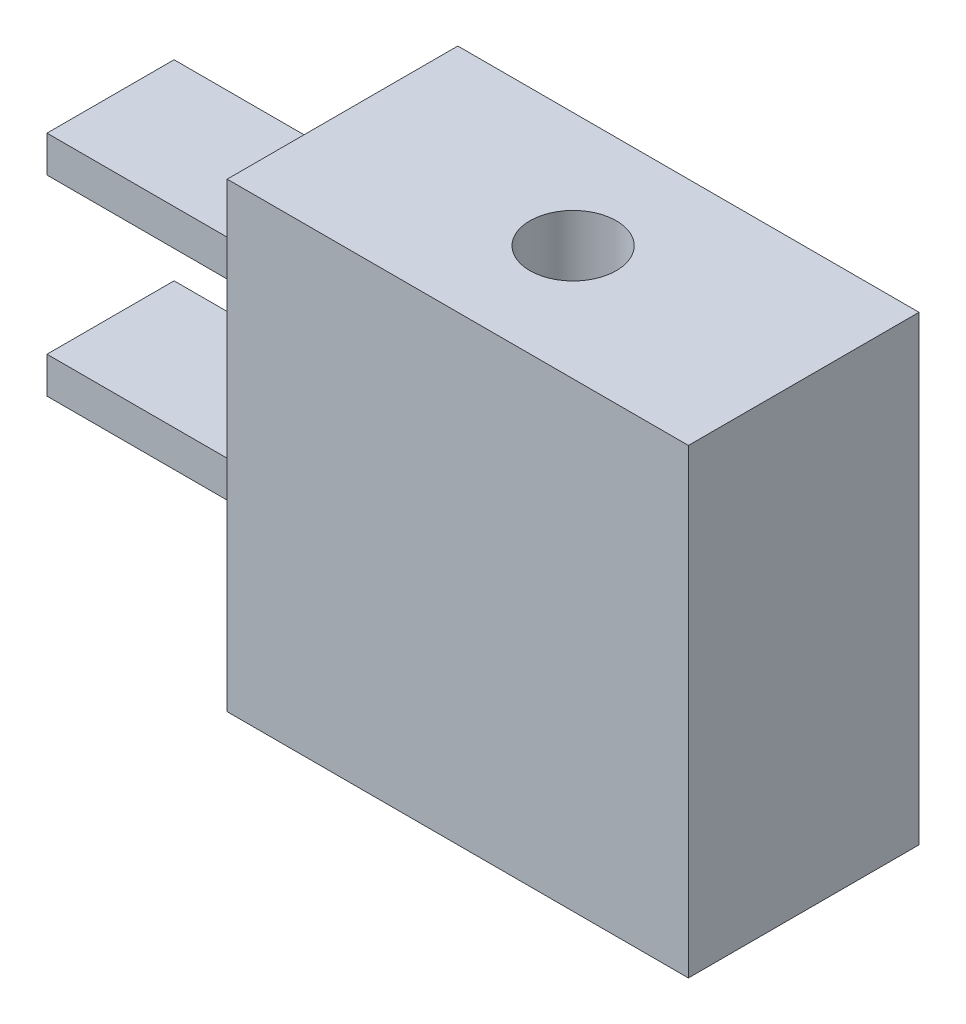
ISO-10303-21;
HEADER;
FILE_DESCRIPTION(('STEP AP214'),'2;1');
FILE_NAME('part.step','',(''),(''),'','','');
FILE_SCHEMA(('AUTOMOTIVE_DESIGN { 1 0 10303 214 1 1 1 1 }'));
ENDSEC;
DATA;
#1=APPLICATION_CONTEXT('core data for automotive mechanical design processes');
#2=APPLICATION_PROTOCOL_DEFINITION('international standard','automotive_design',2000,#1);
#3=PRODUCT_CONTEXT('',#1,'mechanical');
#4=PRODUCT('Part','Part','',(#3));
#5=PRODUCT_RELATED_PRODUCT_CATEGORY('part','',(#4));
#6=PRODUCT_DEFINITION_FORMATION('','',#4);
#7=PRODUCT_DEFINITION_CONTEXT('part definition',#1,'design');
#8=PRODUCT_DEFINITION('design','',#6,#7);
#9=PRODUCT_DEFINITION_SHAPE('','',#8);
#10=(LENGTH_UNIT() NAMED_UNIT(*) SI_UNIT(.MILLI.,.METRE.));
#11=(NAMED_UNIT(*) PLANE_ANGLE_UNIT() SI_UNIT($,.RADIAN.));
#12=(NAMED_UNIT(*) SI_UNIT($,.STERADIAN.) SOLID_ANGLE_UNIT());
#13=UNCERTAINTY_MEASURE_WITH_UNIT(LENGTH_MEASURE(1.E-05),#10,'distance_accuracy_value','');
#14=(GEOMETRIC_REPRESENTATION_CONTEXT(3) GLOBAL_UNCERTAINTY_ASSIGNED_CONTEXT((#13)) GLOBAL_UNIT_ASSIGNED_CONTEXT((#10,
#11,#12)) REPRESENTATION_CONTEXT('',''));
#15=CARTESIAN_POINT('',(0.,0.,0.));
#16=DIRECTION('',(0.,0.,1.));
#17=DIRECTION('',(1.,0.,0.));
#18=AXIS2_PLACEMENT_3D('',#15,#16,#17);
#19=CARTESIAN_POINT('',(-6.35,12.7,3.175));
#20=DIRECTION('',(1.,0.,0.));
#21=DIRECTION('',(0.,0.,-1.));
#22=AXIS2_PLACEMENT_3D('',#19,#20,#21);
#23=PLANE('',#22);
#24=DIRECTION('',(0.,1.,0.));
#25=VECTOR('',#24,1.);
#26=CARTESIAN_POINT('',(-6.35,3.65650049828048,1.78745804836316));
#27=LINE('',#26,#25);
#28=CARTESIAN_POINT('',(-6.35,3.65650049828048,1.78745804836316));
#29=VERTEX_POINT('',#28);
#30=CARTESIAN_POINT('',(-6.35,4.65650049828048,1.78745804836316));
#31=VERTEX_POINT('',#30);
#32=EDGE_CURVE('E147',#29,#31,#27,.T.);
#33=ORIENTED_EDGE('',*,*,#32,.F.);
#34=DIRECTION('',(0.,0.,1.));
#35=VECTOR('',#34,1.);
#36=CARTESIAN_POINT('',(-6.35,3.65650049828048,-1.71254195163684));
#37=LINE('',#36,#35);
#38=CARTESIAN_POINT('',(-6.35,3.65650049828048,-1.71254195163684));
#39=VERTEX_POINT('',#38);
#40=EDGE_CURVE('E160',#39,#29,#37,.T.);
#41=ORIENTED_EDGE('',*,*,#40,.F.);
#42=DIRECTION('',(0.,-1.,0.));
#43=VECTOR('',#42,1.);
#44=CARTESIAN_POINT('',(-6.35,3.65650049828048,-1.71254195163684));
#45=LINE('',#44,#43);
#46=CARTESIAN_POINT('',(-6.35,4.65650049828048,-1.71254195163684));
#47=VERTEX_POINT('',#46);
#48=EDGE_CURVE('E169',#47,#39,#45,.T.);
#49=ORIENTED_EDGE('',*,*,#48,.F.);
#50=DIRECTION('',(0.,0.,-1.));
#51=VECTOR('',#50,1.);
#52=CARTESIAN_POINT('',(-6.35,4.65650049828048,-1.71254195163684));
#53=LINE('',#52,#51);
#54=EDGE_CURVE('E150',#31,#47,#53,.T.);
#55=ORIENTED_EDGE('',*,*,#54,.F.);
#56=EDGE_LOOP('',(#33,#41,#49,#55));
#57=FACE_BOUND('',#56,.T.);
#58=DIRECTION('',(0.,0.,1.));
#59=VECTOR('',#58,1.);
#60=CARTESIAN_POINT('',(-6.35,0.,3.175));
#61=LINE('',#60,#59);
#62=CARTESIAN_POINT('',(-6.35,0.,-3.175));
#63=VERTEX_POINT('',#62);
#64=CARTESIAN_POINT('',(-6.35,0.,3.175));
#65=VERTEX_POINT('',#64);
#66=EDGE_CURVE('E207',#63,#65,#61,.T.);
#67=ORIENTED_EDGE('',*,*,#66,.T.);
#68=DIRECTION('',(0.,-1.,0.));
#69=VECTOR('',#68,1.);
#70=CARTESIAN_POINT('',(-6.35,12.7,3.175));
#71=LINE('',#70,#69);
#72=CARTESIAN_POINT('',(-6.35,12.7,3.175));
#73=VERTEX_POINT('',#72);
#74=EDGE_CURVE('E212',#73,#65,#71,.T.);
#75=ORIENTED_EDGE('',*,*,#74,.F.);
#76=DIRECTION('',(0.,0.,1.));
#77=VECTOR('',#76,1.);
#78=CARTESIAN_POINT('',(-6.35,12.7,3.175));
#79=LINE('',#78,#77);
#80=CARTESIAN_POINT('',(-6.35,12.7,-3.175));
#81=VERTEX_POINT('',#80);
#82=EDGE_CURVE('E198',#81,#73,#79,.T.);
#83=ORIENTED_EDGE('',*,*,#82,.F.);
#84=DIRECTION('',(0.,-1.,0.));
#85=VECTOR('',#84,1.);
#86=CARTESIAN_POINT('',(-6.35,12.7,-3.175));
#87=LINE('',#86,#85);
#88=EDGE_CURVE('E45',#81,#63,#87,.T.);
#89=ORIENTED_EDGE('',*,*,#88,.T.);
#90=EDGE_LOOP('',(#67,#75,#83,#89));
#91=FACE_BOUND('',#90,.T.);
#92=DIRECTION('',(0.,1.,0.));
#93=VECTOR('',#92,1.);
#94=CARTESIAN_POINT('',(-6.35,8.92854928618669,1.78745804836316));
#95=LINE('',#94,#93);
#96=CARTESIAN_POINT('',(-6.35,8.92854928618669,1.78745804836316));
#97=VERTEX_POINT('',#96);
#98=CARTESIAN_POINT('',(-6.35,9.92854928618669,1.78745804836316));
#99=VERTEX_POINT('',#98);
#100=EDGE_CURVE('E146',#97,#99,#95,.T.);
#101=ORIENTED_EDGE('',*,*,#100,.F.);
#102=DIRECTION('',(0.,0.,1.));
#103=VECTOR('',#102,1.);
#104=CARTESIAN_POINT('',(-6.35,8.92854928618669,-1.71254195163684));
#105=LINE('',#104,#103);
#106=CARTESIAN_POINT('',(-6.35,8.92854928618669,-1.71254195163684));
#107=VERTEX_POINT('',#106);
#108=EDGE_CURVE('E143',#107,#97,#105,.T.);
#109=ORIENTED_EDGE('',*,*,#108,.F.);
#110=DIRECTION('',(0.,-1.,0.));
#111=VECTOR('',#110,1.);
#112=CARTESIAN_POINT('',(-6.35,8.92854928618669,-1.71254195163684));
#113=LINE('',#112,#111);
#114=CARTESIAN_POINT('',(-6.35,9.92854928618669,-1.71254195163684));
#115=VERTEX_POINT('',#114);
#116=EDGE_CURVE('E57',#115,#107,#113,.T.);
#117=ORIENTED_EDGE('',*,*,#116,.F.);
#118=DIRECTION('',(0.,0.,-1.));
#119=VECTOR('',#118,1.);
#120=CARTESIAN_POINT('',(-6.35,9.92854928618669,-1.71254195163684));
#121=LINE('',#120,#119);
#122=EDGE_CURVE('E52',#99,#115,#121,.T.);
#123=ORIENTED_EDGE('',*,*,#122,.F.);
#124=EDGE_LOOP('',(#101,#109,#117,#123));
#125=FACE_BOUND('',#124,.T.);
#126=ADVANCED_FACE('F37',(#57,#91,#125),#23,.F.);
#127=CARTESIAN_POINT('',(6.35,12.7,3.175));
#128=DIRECTION('',(-1.,0.,0.));
#129=DIRECTION('',(0.,0.,1.));
#130=AXIS2_PLACEMENT_3D('',#127,#128,#129);
#131=PLANE('',#130);
#132=DIRECTION('',(0.,0.,-1.));
#133=VECTOR('',#132,1.);
#134=CARTESIAN_POINT('',(6.35,0.,3.175));
#135=LINE('',#134,#133);
#136=CARTESIAN_POINT('',(6.35,0.,3.175));
#137=VERTEX_POINT('',#136);
#138=CARTESIAN_POINT('',(6.35,0.,-3.175));
#139=VERTEX_POINT('',#138);
#140=EDGE_CURVE('E189',#137,#139,#135,.T.);
#141=ORIENTED_EDGE('',*,*,#140,.T.);
#142=DIRECTION('',(0.,-1.,0.));
#143=VECTOR('',#142,1.);
#144=CARTESIAN_POINT('',(6.35,12.7,-3.175));
#145=LINE('',#144,#143);
#146=CARTESIAN_POINT('',(6.35,12.7,-3.175));
#147=VERTEX_POINT('',#146);
#148=EDGE_CURVE('E11',#147,#139,#145,.T.);
#149=ORIENTED_EDGE('',*,*,#148,.F.);
#150=DIRECTION('',(0.,0.,-1.));
#151=VECTOR('',#150,1.);
#152=CARTESIAN_POINT('',(6.35,12.7,3.175));
#153=LINE('',#152,#151);
#154=CARTESIAN_POINT('',(6.35,12.7,3.175));
#155=VERTEX_POINT('',#154);
#156=EDGE_CURVE('E192',#155,#147,#153,.T.);
#157=ORIENTED_EDGE('',*,*,#156,.F.);
#158=DIRECTION('',(0.,-1.,0.));
#159=VECTOR('',#158,1.);
#160=CARTESIAN_POINT('',(6.35,12.7,3.175));
#161=LINE('',#160,#159);
#162=EDGE_CURVE('E202',#155,#137,#161,.T.);
#163=ORIENTED_EDGE('',*,*,#162,.T.);
#164=EDGE_LOOP('',(#141,#149,#157,#163));
#165=FACE_BOUND('',#164,.T.);
#166=ADVANCED_FACE('F39',(#165),#131,.F.);
#167=CARTESIAN_POINT('',(-6.35,12.7,-3.175));
#168=DIRECTION('',(0.,0.,1.));
#169=DIRECTION('',(1.,0.,0.));
#170=AXIS2_PLACEMENT_3D('',#167,#168,#169);
#171=PLANE('',#170);
#172=DIRECTION('',(-1.,0.,0.));
#173=VECTOR('',#172,1.);
#174=CARTESIAN_POINT('',(-6.35,0.,-3.175));
#175=LINE('',#174,#173);
#176=EDGE_CURVE('E205',#139,#63,#175,.T.);
#177=ORIENTED_EDGE('',*,*,#176,.T.);
#178=ORIENTED_EDGE('',*,*,#88,.F.);
#179=DIRECTION('',(-1.,0.,0.));
#180=VECTOR('',#179,1.);
#181=CARTESIAN_POINT('',(-6.35,12.7,-3.175));
#182=LINE('',#181,#180);
#183=EDGE_CURVE('E195',#147,#81,#182,.T.);
#184=ORIENTED_EDGE('',*,*,#183,.F.);
#185=ORIENTED_EDGE('',*,*,#148,.T.);
#186=EDGE_LOOP('',(#177,#178,#184,#185));
#187=FACE_BOUND('',#186,.T.);
#188=ADVANCED_FACE('F234',(#187),#171,.F.);
#189=CARTESIAN_POINT('',(-6.35,12.7,3.175));
#190=DIRECTION('',(0.,0.,-1.));
#191=DIRECTION('',(-1.,0.,0.));
#192=AXIS2_PLACEMENT_3D('',#189,#190,#191);
#193=PLANE('',#192);
#194=DIRECTION('',(1.,0.,0.));
#195=VECTOR('',#194,1.);
#196=CARTESIAN_POINT('',(-6.35,0.,3.175));
#197=LINE('',#196,#195);
#198=EDGE_CURVE('E196',#65,#137,#197,.T.);
#199=ORIENTED_EDGE('',*,*,#198,.T.);
#200=ORIENTED_EDGE('',*,*,#162,.F.);
#201=DIRECTION('',(1.,0.,0.));
#202=VECTOR('',#201,1.);
#203=CARTESIAN_POINT('',(-6.35,12.7,3.175));
#204=LINE('',#203,#202);
#205=EDGE_CURVE('E200',#73,#155,#204,.T.);
#206=ORIENTED_EDGE('',*,*,#205,.F.);
#207=ORIENTED_EDGE('',*,*,#74,.T.);
#208=EDGE_LOOP('',(#199,#200,#206,#207));
#209=FACE_BOUND('',#208,.T.);
#210=ADVANCED_FACE('F227',(#209),#193,.F.);
#211=CARTESIAN_POINT('',(0.,12.7,0.));
#212=DIRECTION('',(0.,-1.,0.));
#213=DIRECTION('',(0.,0.,-1.));
#214=AXIS2_PLACEMENT_3D('',#211,#212,#213);
#215=PLANE('',#214);
#216=CARTESIAN_POINT('',(0.,12.7,0.));
#217=DIRECTION('',(0.,1.,0.));
#218=DIRECTION('',(0.,0.,1.));
#219=AXIS2_PLACEMENT_3D('',#216,#217,#218);
#220=CIRCLE('',#219,1.190625);
#221=CARTESIAN_POINT('',(0.,12.7,1.190625));
#222=VERTEX_POINT('',#221);
#223=EDGE_CURVE('E185',#222,#222,#220,.T.);
#224=ORIENTED_EDGE('',*,*,#223,.F.);
#225=EDGE_LOOP('',(#224));
#226=FACE_BOUND('',#225,.T.);
#227=ORIENTED_EDGE('',*,*,#156,.T.);
#228=ORIENTED_EDGE('',*,*,#183,.T.);
#229=ORIENTED_EDGE('',*,*,#82,.T.);
#230=ORIENTED_EDGE('',*,*,#205,.T.);
#231=EDGE_LOOP('',(#227,#228,#229,#230));
#232=FACE_BOUND('',#231,.T.);
#233=ADVANCED_FACE('F233',(#226,#232),#215,.F.);
#234=CARTESIAN_POINT('',(0.,0.,0.));
#235=DIRECTION('',(0.,-1.,0.));
#236=DIRECTION('',(0.,0.,-1.));
#237=AXIS2_PLACEMENT_3D('',#234,#235,#236);
#238=PLANE('',#237);
#239=ORIENTED_EDGE('',*,*,#140,.F.);
#240=ORIENTED_EDGE('',*,*,#198,.F.);
#241=ORIENTED_EDGE('',*,*,#66,.F.);
#242=ORIENTED_EDGE('',*,*,#176,.F.);
#243=EDGE_LOOP('',(#239,#240,#241,#242));
#244=FACE_BOUND('',#243,.T.);
#245=ADVANCED_FACE('F224',(#244),#238,.T.);
#246=CARTESIAN_POINT('',(0.,9.7,0.));
#247=DIRECTION('',(0.,1.,0.));
#248=DIRECTION('',(0.,0.,1.));
#249=AXIS2_PLACEMENT_3D('',#246,#247,#248);
#250=CYLINDRICAL_SURFACE('',#249,1.190625);
#251=CARTESIAN_POINT('',(0.,9.7,0.));
#252=DIRECTION('',(0.,1.,0.));
#253=DIRECTION('',(0.,0.,1.));
#254=AXIS2_PLACEMENT_3D('',#251,#252,#253);
#255=CIRCLE('',#254,1.190625);
#256=CARTESIAN_POINT('',(0.,9.7,1.190625));
#257=VERTEX_POINT('',#256);
#258=EDGE_CURVE('E186',#257,#257,#255,.T.);
#259=ORIENTED_EDGE('',*,*,#258,.F.);
#260=EDGE_LOOP('',(#259));
#261=FACE_BOUND('',#260,.T.);
#262=ORIENTED_EDGE('',*,*,#223,.T.);
#263=EDGE_LOOP('',(#262));
#264=FACE_BOUND('',#263,.T.);
#265=ADVANCED_FACE('F249',(#261,#264),#250,.F.);
#266=CARTESIAN_POINT('',(0.,9.7,0.));
#267=DIRECTION('',(0.,1.,0.));
#268=DIRECTION('',(0.,0.,1.));
#269=AXIS2_PLACEMENT_3D('',#266,#267,#268);
#270=PLANE('',#269);
#271=ORIENTED_EDGE('',*,*,#258,.T.);
#272=EDGE_LOOP('',(#271));
#273=FACE_BOUND('',#272,.T.);
#274=ADVANCED_FACE('F255',(#273),#270,.T.);
#275=CARTESIAN_POINT('',(-12.7,3.65650049828048,1.78745804836316));
#276=DIRECTION('',(0.,0.,-1.));
#277=DIRECTION('',(-1.,0.,0.));
#278=AXIS2_PLACEMENT_3D('',#275,#276,#277);
#279=PLANE('',#278);
#280=ORIENTED_EDGE('',*,*,#32,.T.);
#281=DIRECTION('',(1.,0.,0.));
#282=VECTOR('',#281,1.);
#283=CARTESIAN_POINT('',(-12.7,4.65650049828048,1.78745804836316));
#284=LINE('',#283,#282);
#285=CARTESIAN_POINT('',(-12.7,4.65650049828048,1.78745804836316));
#286=VERTEX_POINT('',#285);
#287=EDGE_CURVE('E182',#286,#31,#284,.T.);
#288=ORIENTED_EDGE('',*,*,#287,.F.);
#289=DIRECTION('',(0.,1.,0.));
#290=VECTOR('',#289,1.);
#291=CARTESIAN_POINT('',(-12.7,3.65650049828048,1.78745804836316));
#292=LINE('',#291,#290);
#293=CARTESIAN_POINT('',(-12.7,3.65650049828048,1.78745804836316));
#294=VERTEX_POINT('',#293);
#295=EDGE_CURVE('E156',#294,#286,#292,.T.);
#296=ORIENTED_EDGE('',*,*,#295,.F.);
#297=DIRECTION('',(1.,0.,0.));
#298=VECTOR('',#297,1.);
#299=CARTESIAN_POINT('',(-12.7,3.65650049828048,1.78745804836316));
#300=LINE('',#299,#298);
#301=EDGE_CURVE('E165',#294,#29,#300,.T.);
#302=ORIENTED_EDGE('',*,*,#301,.T.);
#303=EDGE_LOOP('',(#280,#288,#296,#302));
#304=FACE_BOUND('',#303,.T.);
#305=ADVANCED_FACE('F259',(#304),#279,.F.);
#306=CARTESIAN_POINT('',(-12.7,4.65650049828048,-1.71254195163684));
#307=DIRECTION('',(0.,-1.,0.));
#308=DIRECTION('',(0.,0.,-1.));
#309=AXIS2_PLACEMENT_3D('',#306,#307,#308);
#310=PLANE('',#309);
#311=ORIENTED_EDGE('',*,*,#54,.T.);
#312=DIRECTION('',(1.,0.,0.));
#313=VECTOR('',#312,1.);
#314=CARTESIAN_POINT('',(-12.7,4.65650049828048,-1.71254195163684));
#315=LINE('',#314,#313);
#316=CARTESIAN_POINT('',(-12.7,4.65650049828048,-1.71254195163684));
#317=VERTEX_POINT('',#316);
#318=EDGE_CURVE('E179',#317,#47,#315,.T.);
#319=ORIENTED_EDGE('',*,*,#318,.F.);
#320=DIRECTION('',(0.,0.,-1.));
#321=VECTOR('',#320,1.);
#322=CARTESIAN_POINT('',(-12.7,4.65650049828048,-1.71254195163684));
#323=LINE('',#322,#321);
#324=EDGE_CURVE('E159',#286,#317,#323,.T.);
#325=ORIENTED_EDGE('',*,*,#324,.F.);
#326=ORIENTED_EDGE('',*,*,#287,.T.);
#327=EDGE_LOOP('',(#311,#319,#325,#326));
#328=FACE_BOUND('',#327,.T.);
#329=ADVANCED_FACE('F263',(#328),#310,.F.);
#330=CARTESIAN_POINT('',(-12.7,3.65650049828048,-1.71254195163684));
#331=DIRECTION('',(0.,0.,1.));
#332=DIRECTION('',(1.,0.,0.));
#333=AXIS2_PLACEMENT_3D('',#330,#331,#332);
#334=PLANE('',#333);
#335=ORIENTED_EDGE('',*,*,#48,.T.);
#336=DIRECTION('',(1.,0.,0.));
#337=VECTOR('',#336,1.);
#338=CARTESIAN_POINT('',(-12.7,3.65650049828048,-1.71254195163684));
#339=LINE('',#338,#337);
#340=CARTESIAN_POINT('',(-12.7,3.65650049828048,-1.71254195163684));
#341=VERTEX_POINT('',#340);
#342=EDGE_CURVE('E176',#341,#39,#339,.T.);
#343=ORIENTED_EDGE('',*,*,#342,.F.);
#344=DIRECTION('',(0.,-1.,0.));
#345=VECTOR('',#344,1.);
#346=CARTESIAN_POINT('',(-12.7,3.65650049828048,-1.71254195163684));
#347=LINE('',#346,#345);
#348=EDGE_CURVE('E162',#317,#341,#347,.T.);
#349=ORIENTED_EDGE('',*,*,#348,.F.);
#350=ORIENTED_EDGE('',*,*,#318,.T.);
#351=EDGE_LOOP('',(#335,#343,#349,#350));
#352=FACE_BOUND('',#351,.T.);
#353=ADVANCED_FACE('F267',(#352),#334,.F.);
#354=CARTESIAN_POINT('',(-12.7,3.65650049828048,-1.71254195163684));
#355=DIRECTION('',(0.,1.,0.));
#356=DIRECTION('',(0.,0.,1.));
#357=AXIS2_PLACEMENT_3D('',#354,#355,#356);
#358=PLANE('',#357);
#359=ORIENTED_EDGE('',*,*,#40,.T.);
#360=ORIENTED_EDGE('',*,*,#301,.F.);
#361=DIRECTION('',(0.,0.,1.));
#362=VECTOR('',#361,1.);
#363=CARTESIAN_POINT('',(-12.7,3.65650049828048,-1.71254195163684));
#364=LINE('',#363,#362);
#365=EDGE_CURVE('E164',#341,#294,#364,.T.);
#366=ORIENTED_EDGE('',*,*,#365,.F.);
#367=ORIENTED_EDGE('',*,*,#342,.T.);
#368=EDGE_LOOP('',(#359,#360,#366,#367));
#369=FACE_BOUND('',#368,.T.);
#370=ADVANCED_FACE('F271',(#369),#358,.F.);
#371=CARTESIAN_POINT('',(-12.7,0.,0.));
#372=DIRECTION('',(1.,0.,0.));
#373=DIRECTION('',(0.,0.,-1.));
#374=AXIS2_PLACEMENT_3D('',#371,#372,#373);
#375=PLANE('',#374);
#376=ORIENTED_EDGE('',*,*,#295,.T.);
#377=ORIENTED_EDGE('',*,*,#324,.T.);
#378=ORIENTED_EDGE('',*,*,#348,.T.);
#379=ORIENTED_EDGE('',*,*,#365,.T.);
#380=EDGE_LOOP('',(#376,#377,#378,#379));
#381=FACE_BOUND('',#380,.T.);
#382=ADVANCED_FACE('F275',(#381),#375,.F.);
#383=CARTESIAN_POINT('',(-12.7,8.92854928618669,1.78745804836316));
#384=DIRECTION('',(0.,0.,-1.));
#385=DIRECTION('',(-1.,0.,0.));
#386=AXIS2_PLACEMENT_3D('',#383,#384,#385);
#387=PLANE('',#386);
#388=ORIENTED_EDGE('',*,*,#100,.T.);
#389=DIRECTION('',(1.,0.,0.));
#390=VECTOR('',#389,1.);
#391=CARTESIAN_POINT('',(-12.7,9.92854928618669,1.78745804836316));
#392=LINE('',#391,#390);
#393=CARTESIAN_POINT('',(-12.7,9.92854928618669,1.78745804836316));
#394=VERTEX_POINT('',#393);
#395=EDGE_CURVE('E127',#394,#99,#392,.T.);
#396=ORIENTED_EDGE('',*,*,#395,.F.);
#397=DIRECTION('',(0.,1.,0.));
#398=VECTOR('',#397,1.);
#399=CARTESIAN_POINT('',(-12.7,8.92854928618669,1.78745804836316));
#400=LINE('',#399,#398);
#401=CARTESIAN_POINT('',(-12.7,8.92854928618669,1.78745804836316));
#402=VERTEX_POINT('',#401);
#403=EDGE_CURVE('E134',#402,#394,#400,.T.);
#404=ORIENTED_EDGE('',*,*,#403,.F.);
#405=DIRECTION('',(1.,0.,0.));
#406=VECTOR('',#405,1.);
#407=CARTESIAN_POINT('',(-12.7,8.92854928618669,1.78745804836316));
#408=LINE('',#407,#406);
#409=EDGE_CURVE('E399',#402,#97,#408,.T.);
#410=ORIENTED_EDGE('',*,*,#409,.T.);
#411=EDGE_LOOP('',(#388,#396,#404,#410));
#412=FACE_BOUND('',#411,.T.);
#413=ADVANCED_FACE('F145',(#412),#387,.F.);
#414=CARTESIAN_POINT('',(-12.7,9.92854928618669,-1.71254195163684));
#415=DIRECTION('',(0.,-1.,0.));
#416=DIRECTION('',(0.,0.,-1.));
#417=AXIS2_PLACEMENT_3D('',#414,#415,#416);
#418=PLANE('',#417);
#419=ORIENTED_EDGE('',*,*,#122,.T.);
#420=DIRECTION('',(1.,0.,0.));
#421=VECTOR('',#420,1.);
#422=CARTESIAN_POINT('',(-12.7,9.92854928618669,-1.71254195163684));
#423=LINE('',#422,#421);
#424=CARTESIAN_POINT('',(-12.7,9.92854928618669,-1.71254195163684));
#425=VERTEX_POINT('',#424);
#426=EDGE_CURVE('E130',#425,#115,#423,.T.);
#427=ORIENTED_EDGE('',*,*,#426,.F.);
#428=DIRECTION('',(0.,0.,-1.));
#429=VECTOR('',#428,1.);
#430=CARTESIAN_POINT('',(-12.7,9.92854928618669,-1.71254195163684));
#431=LINE('',#430,#429);
#432=EDGE_CURVE('E123',#394,#425,#431,.T.);
#433=ORIENTED_EDGE('',*,*,#432,.F.);
#434=ORIENTED_EDGE('',*,*,#395,.T.);
#435=EDGE_LOOP('',(#419,#427,#433,#434));
#436=FACE_BOUND('',#435,.T.);
#437=ADVANCED_FACE('F125',(#436),#418,.F.);
#438=CARTESIAN_POINT('',(-12.7,8.92854928618669,-1.71254195163684));
#439=DIRECTION('',(0.,0.,1.));
#440=DIRECTION('',(1.,0.,0.));
#441=AXIS2_PLACEMENT_3D('',#438,#439,#440);
#442=PLANE('',#441);
#443=ORIENTED_EDGE('',*,*,#116,.T.);
#444=DIRECTION('',(1.,0.,0.));
#445=VECTOR('',#444,1.);
#446=CARTESIAN_POINT('',(-12.7,8.92854928618669,-1.71254195163684));
#447=LINE('',#446,#445);
#448=CARTESIAN_POINT('',(-12.7,8.92854928618669,-1.71254195163684));
#449=VERTEX_POINT('',#448);
#450=EDGE_CURVE('E152',#449,#107,#447,.T.);
#451=ORIENTED_EDGE('',*,*,#450,.F.);
#452=DIRECTION('',(0.,-1.,0.));
#453=VECTOR('',#452,1.);
#454=CARTESIAN_POINT('',(-12.7,8.92854928618669,-1.71254195163684));
#455=LINE('',#454,#453);
#456=EDGE_CURVE('E133',#425,#449,#455,.T.);
#457=ORIENTED_EDGE('',*,*,#456,.F.);
#458=ORIENTED_EDGE('',*,*,#426,.T.);
#459=EDGE_LOOP('',(#443,#451,#457,#458));
#460=FACE_BOUND('',#459,.T.);
#461=ADVANCED_FACE('F284',(#460),#442,.F.);
#462=CARTESIAN_POINT('',(-12.7,8.92854928618669,-1.71254195163684));
#463=DIRECTION('',(0.,1.,0.));
#464=DIRECTION('',(0.,0.,1.));
#465=AXIS2_PLACEMENT_3D('',#462,#463,#464);
#466=PLANE('',#465);
#467=ORIENTED_EDGE('',*,*,#108,.T.);
#468=ORIENTED_EDGE('',*,*,#409,.F.);
#469=DIRECTION('',(0.,0.,1.));
#470=VECTOR('',#469,1.);
#471=CARTESIAN_POINT('',(-12.7,8.92854928618669,-1.71254195163684));
#472=LINE('',#471,#470);
#473=EDGE_CURVE('E139',#449,#402,#472,.T.);
#474=ORIENTED_EDGE('',*,*,#473,.F.);
#475=ORIENTED_EDGE('',*,*,#450,.T.);
#476=EDGE_LOOP('',(#467,#468,#474,#475));
#477=FACE_BOUND('',#476,.T.);
#478=ADVANCED_FACE('F287',(#477),#466,.F.);
#479=CARTESIAN_POINT('',(-12.7,0.,0.));
#480=DIRECTION('',(1.,0.,0.));
#481=DIRECTION('',(0.,0.,-1.));
#482=AXIS2_PLACEMENT_3D('',#479,#480,#481);
#483=PLANE('',#482);
#484=ORIENTED_EDGE('',*,*,#403,.T.);
#485=ORIENTED_EDGE('',*,*,#432,.T.);
#486=ORIENTED_EDGE('',*,*,#456,.T.);
#487=ORIENTED_EDGE('',*,*,#473,.T.);
#488=EDGE_LOOP('',(#484,#485,#486,#487));
#489=FACE_BOUND('',#488,.T.);
#490=ADVANCED_FACE('F137',(#489),#483,.F.);
#491=CLOSED_SHELL('',(#126,#166,#188,#210,#233,#245,#265,#274,#305,#329,#353,#370,#382,#413,
#437,#461,#478,#490));
#492=MANIFOLD_SOLID_BREP('B2',#491);
#493=ADVANCED_BREP_SHAPE_REPRESENTATION('',(#18,#492),#14);
#494=SHAPE_DEFINITION_REPRESENTATION(#9,#493);
ENDSEC;
END-ISO-10303-21;
